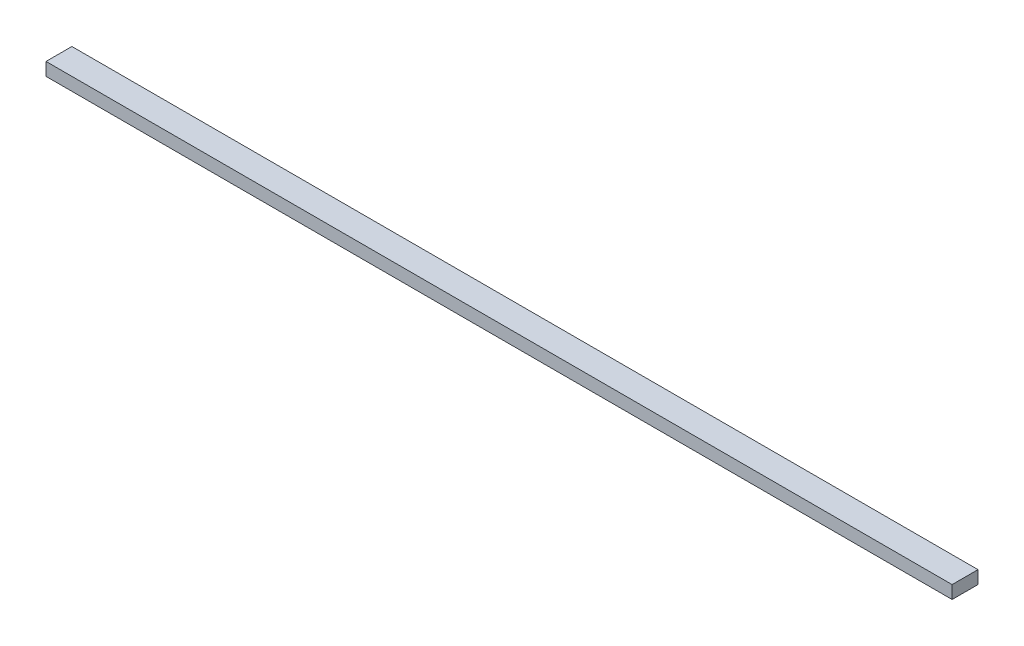
ISO-10303-21;
HEADER;
FILE_DESCRIPTION(('STEP AP214'),'2;1');
FILE_NAME('part.step','',(''),(''),'','','');
FILE_SCHEMA(('AUTOMOTIVE_DESIGN { 1 0 10303 214 1 1 1 1 }'));
ENDSEC;
DATA;
#1=APPLICATION_CONTEXT('core data for automotive mechanical design processes');
#2=APPLICATION_PROTOCOL_DEFINITION('international standard','automotive_design',2000,#1);
#3=PRODUCT_CONTEXT('',#1,'mechanical');
#4=PRODUCT('Part','Part','',(#3));
#5=PRODUCT_RELATED_PRODUCT_CATEGORY('part','',(#4));
#6=PRODUCT_DEFINITION_FORMATION('','',#4);
#7=PRODUCT_DEFINITION_CONTEXT('part definition',#1,'design');
#8=PRODUCT_DEFINITION('design','',#6,#7);
#9=PRODUCT_DEFINITION_SHAPE('','',#8);
#10=(LENGTH_UNIT() NAMED_UNIT(*) SI_UNIT(.MILLI.,.METRE.));
#11=(NAMED_UNIT(*) PLANE_ANGLE_UNIT() SI_UNIT($,.RADIAN.));
#12=(NAMED_UNIT(*) SI_UNIT($,.STERADIAN.) SOLID_ANGLE_UNIT());
#13=UNCERTAINTY_MEASURE_WITH_UNIT(LENGTH_MEASURE(1.E-05),#10,'distance_accuracy_value','');
#14=(GEOMETRIC_REPRESENTATION_CONTEXT(3) GLOBAL_UNCERTAINTY_ASSIGNED_CONTEXT((#13)) GLOBAL_UNIT_ASSIGNED_CONTEXT((#10,
#11,#12)) REPRESENTATION_CONTEXT('',''));
#15=CARTESIAN_POINT('',(0.,0.,0.));
#16=DIRECTION('',(0.,0.,1.));
#17=DIRECTION('',(1.,0.,0.));
#18=AXIS2_PLACEMENT_3D('',#15,#16,#17);
#19=CARTESIAN_POINT('',(0.,10.,0.));
#20=DIRECTION('',(1.,0.,0.));
#21=DIRECTION('',(0.,0.,-1.));
#22=AXIS2_PLACEMENT_3D('',#19,#20,#21);
#23=PLANE('',#22);
#24=DIRECTION('',(0.,0.,1.));
#25=VECTOR('',#24,1.);
#26=CARTESIAN_POINT('',(0.,0.,0.));
#27=LINE('',#26,#25);
#28=CARTESIAN_POINT('',(0.,0.,-20.));
#29=VERTEX_POINT('',#28);
#30=CARTESIAN_POINT('',(0.,0.,0.));
#31=VERTEX_POINT('',#30);
#32=EDGE_CURVE('E94',#29,#31,#27,.T.);
#33=ORIENTED_EDGE('',*,*,#32,.T.);
#34=DIRECTION('',(0.,-1.,0.));
#35=VECTOR('',#34,1.);
#36=CARTESIAN_POINT('',(0.,10.,0.));
#37=LINE('',#36,#35);
#38=CARTESIAN_POINT('',(0.,10.,0.));
#39=VERTEX_POINT('',#38);
#40=EDGE_CURVE('E11',#39,#31,#37,.T.);
#41=ORIENTED_EDGE('',*,*,#40,.F.);
#42=DIRECTION('',(0.,0.,1.));
#43=VECTOR('',#42,1.);
#44=CARTESIAN_POINT('',(0.,10.,0.));
#45=LINE('',#44,#43);
#46=CARTESIAN_POINT('',(0.,10.,-20.));
#47=VERTEX_POINT('',#46);
#48=EDGE_CURVE('E82',#47,#39,#45,.T.);
#49=ORIENTED_EDGE('',*,*,#48,.F.);
#50=DIRECTION('',(0.,-1.,0.));
#51=VECTOR('',#50,1.);
#52=CARTESIAN_POINT('',(0.,10.,-20.));
#53=LINE('',#52,#51);
#54=EDGE_CURVE('E90',#47,#29,#53,.T.);
#55=ORIENTED_EDGE('',*,*,#54,.T.);
#56=EDGE_LOOP('',(#33,#41,#49,#55));
#57=FACE_BOUND('',#56,.T.);
#58=ADVANCED_FACE('F31',(#57),#23,.F.);
#59=CARTESIAN_POINT('',(0.,10.,0.));
#60=DIRECTION('',(0.,0.,-1.));
#61=DIRECTION('',(-1.,0.,0.));
#62=AXIS2_PLACEMENT_3D('',#59,#60,#61);
#63=PLANE('',#62);
#64=DIRECTION('',(1.,0.,0.));
#65=VECTOR('',#64,1.);
#66=CARTESIAN_POINT('',(0.,0.,0.));
#67=LINE('',#66,#65);
#68=CARTESIAN_POINT('',(700.,0.,0.));
#69=VERTEX_POINT('',#68);
#70=EDGE_CURVE('E86',#31,#69,#67,.T.);
#71=ORIENTED_EDGE('',*,*,#70,.T.);
#72=DIRECTION('',(0.,-1.,0.));
#73=VECTOR('',#72,1.);
#74=CARTESIAN_POINT('',(700.,10.,0.));
#75=LINE('',#74,#73);
#76=CARTESIAN_POINT('',(700.,10.,0.));
#77=VERTEX_POINT('',#76);
#78=EDGE_CURVE('E39',#77,#69,#75,.T.);
#79=ORIENTED_EDGE('',*,*,#78,.F.);
#80=DIRECTION('',(1.,0.,0.));
#81=VECTOR('',#80,1.);
#82=CARTESIAN_POINT('',(0.,10.,0.));
#83=LINE('',#82,#81);
#84=EDGE_CURVE('E77',#39,#77,#83,.T.);
#85=ORIENTED_EDGE('',*,*,#84,.F.);
#86=ORIENTED_EDGE('',*,*,#40,.T.);
#87=EDGE_LOOP('',(#71,#79,#85,#86));
#88=FACE_BOUND('',#87,.T.);
#89=ADVANCED_FACE('F85',(#88),#63,.F.);
#90=CARTESIAN_POINT('',(700.,10.,0.));
#91=DIRECTION('',(-1.,0.,0.));
#92=DIRECTION('',(0.,0.,1.));
#93=AXIS2_PLACEMENT_3D('',#90,#91,#92);
#94=PLANE('',#93);
#95=DIRECTION('',(0.,0.,-1.));
#96=VECTOR('',#95,1.);
#97=CARTESIAN_POINT('',(700.,0.,0.));
#98=LINE('',#97,#96);
#99=CARTESIAN_POINT('',(700.,0.,-20.));
#100=VERTEX_POINT('',#99);
#101=EDGE_CURVE('E64',#69,#100,#98,.T.);
#102=ORIENTED_EDGE('',*,*,#101,.T.);
#103=DIRECTION('',(0.,-1.,0.));
#104=VECTOR('',#103,1.);
#105=CARTESIAN_POINT('',(700.,10.,-20.));
#106=LINE('',#105,#104);
#107=CARTESIAN_POINT('',(700.,10.,-20.));
#108=VERTEX_POINT('',#107);
#109=EDGE_CURVE('E87',#108,#100,#106,.T.);
#110=ORIENTED_EDGE('',*,*,#109,.F.);
#111=DIRECTION('',(0.,0.,-1.));
#112=VECTOR('',#111,1.);
#113=CARTESIAN_POINT('',(700.,10.,0.));
#114=LINE('',#113,#112);
#115=EDGE_CURVE('E80',#77,#108,#114,.T.);
#116=ORIENTED_EDGE('',*,*,#115,.F.);
#117=ORIENTED_EDGE('',*,*,#78,.T.);
#118=EDGE_LOOP('',(#102,#110,#116,#117));
#119=FACE_BOUND('',#118,.T.);
#120=ADVANCED_FACE('F88',(#119),#94,.F.);
#121=CARTESIAN_POINT('',(0.,10.,-20.));
#122=DIRECTION('',(0.,0.,1.));
#123=DIRECTION('',(1.,0.,0.));
#124=AXIS2_PLACEMENT_3D('',#121,#122,#123);
#125=PLANE('',#124);
#126=DIRECTION('',(-1.,0.,0.));
#127=VECTOR('',#126,1.);
#128=CARTESIAN_POINT('',(0.,0.,-20.));
#129=LINE('',#128,#127);
#130=EDGE_CURVE('E70',#100,#29,#129,.T.);
#131=ORIENTED_EDGE('',*,*,#130,.T.);
#132=ORIENTED_EDGE('',*,*,#54,.F.);
#133=DIRECTION('',(-1.,0.,0.));
#134=VECTOR('',#133,1.);
#135=CARTESIAN_POINT('',(0.,10.,-20.));
#136=LINE('',#135,#134);
#137=EDGE_CURVE('E47',#108,#47,#136,.T.);
#138=ORIENTED_EDGE('',*,*,#137,.F.);
#139=ORIENTED_EDGE('',*,*,#109,.T.);
#140=EDGE_LOOP('',(#131,#132,#138,#139));
#141=FACE_BOUND('',#140,.T.);
#142=ADVANCED_FACE('F101',(#141),#125,.F.);
#143=CARTESIAN_POINT('',(0.,10.,-20.));
#144=DIRECTION('',(0.,-1.,0.));
#145=DIRECTION('',(0.,0.,-1.));
#146=AXIS2_PLACEMENT_3D('',#143,#144,#145);
#147=PLANE('',#146);
#148=ORIENTED_EDGE('',*,*,#48,.T.);
#149=ORIENTED_EDGE('',*,*,#84,.T.);
#150=ORIENTED_EDGE('',*,*,#115,.T.);
#151=ORIENTED_EDGE('',*,*,#137,.T.);
#152=EDGE_LOOP('',(#148,#149,#150,#151));
#153=FACE_BOUND('',#152,.T.);
#154=ADVANCED_FACE('F78',(#153),#147,.F.);
#155=CARTESIAN_POINT('',(0.,0.,-20.));
#156=DIRECTION('',(0.,-1.,0.));
#157=DIRECTION('',(0.,0.,-1.));
#158=AXIS2_PLACEMENT_3D('',#155,#156,#157);
#159=PLANE('',#158);
#160=ORIENTED_EDGE('',*,*,#32,.F.);
#161=ORIENTED_EDGE('',*,*,#130,.F.);
#162=ORIENTED_EDGE('',*,*,#101,.F.);
#163=ORIENTED_EDGE('',*,*,#70,.F.);
#164=EDGE_LOOP('',(#160,#161,#162,#163));
#165=FACE_BOUND('',#164,.T.);
#166=ADVANCED_FACE('F104',(#165),#159,.T.);
#167=CLOSED_SHELL('',(#58,#89,#120,#142,#154,#166));
#168=MANIFOLD_SOLID_BREP('B2',#167);
#169=ADVANCED_BREP_SHAPE_REPRESENTATION('',(#18,#168),#14);
#170=SHAPE_DEFINITION_REPRESENTATION(#9,#169);
ENDSEC;
END-ISO-10303-21;
